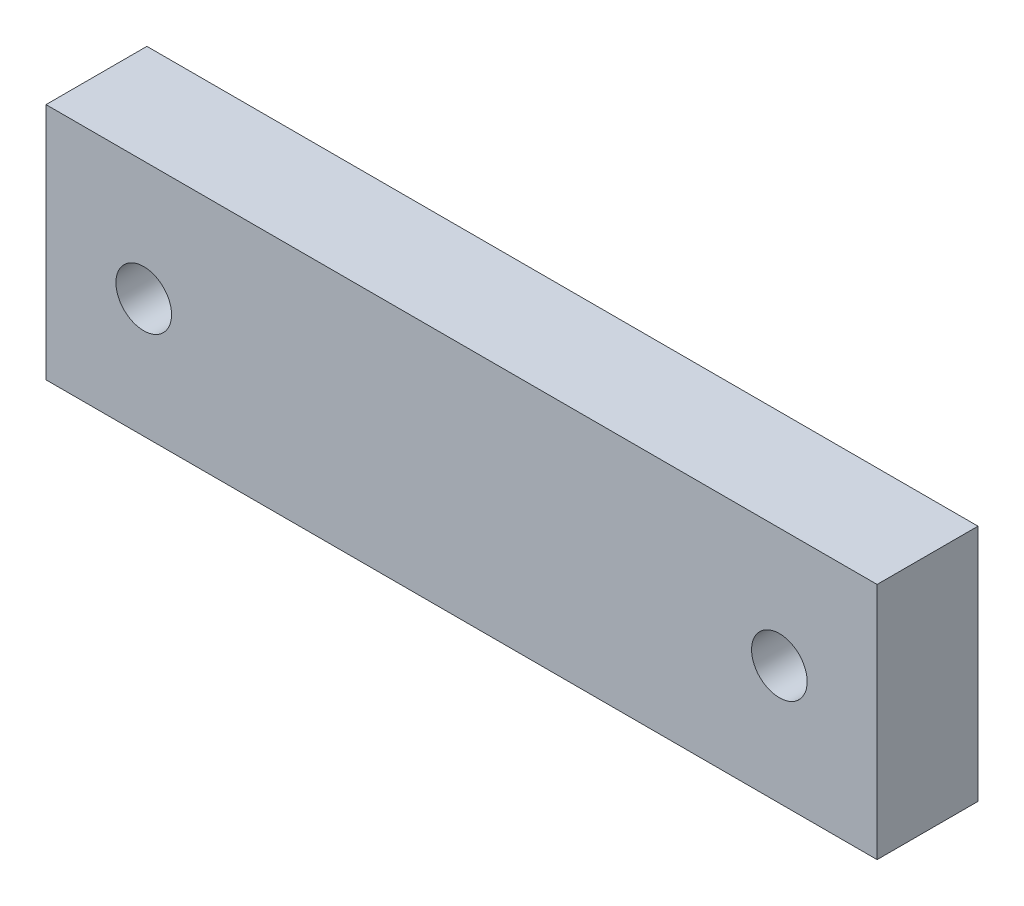
ISO-10303-21;
HEADER;
FILE_DESCRIPTION(('STEP AP214'),'2;1');
FILE_NAME('part.step','',(''),(''),'','','');
FILE_SCHEMA(('AUTOMOTIVE_DESIGN { 1 0 10303 214 1 1 1 1 }'));
ENDSEC;
DATA;
#1=APPLICATION_CONTEXT('core data for automotive mechanical design processes');
#2=APPLICATION_PROTOCOL_DEFINITION('international standard','automotive_design',2000,#1);
#3=PRODUCT_CONTEXT('',#1,'mechanical');
#4=PRODUCT('Part','Part','',(#3));
#5=PRODUCT_RELATED_PRODUCT_CATEGORY('part','',(#4));
#6=PRODUCT_DEFINITION_FORMATION('','',#4);
#7=PRODUCT_DEFINITION_CONTEXT('part definition',#1,'design');
#8=PRODUCT_DEFINITION('design','',#6,#7);
#9=PRODUCT_DEFINITION_SHAPE('','',#8);
#10=(LENGTH_UNIT() NAMED_UNIT(*) SI_UNIT(.MILLI.,.METRE.));
#11=(NAMED_UNIT(*) PLANE_ANGLE_UNIT() SI_UNIT($,.RADIAN.));
#12=(NAMED_UNIT(*) SI_UNIT($,.STERADIAN.) SOLID_ANGLE_UNIT());
#13=UNCERTAINTY_MEASURE_WITH_UNIT(LENGTH_MEASURE(1.E-05),#10,'distance_accuracy_value','');
#14=(GEOMETRIC_REPRESENTATION_CONTEXT(3) GLOBAL_UNCERTAINTY_ASSIGNED_CONTEXT((#13)) GLOBAL_UNIT_ASSIGNED_CONTEXT((#10,
#11,#12)) REPRESENTATION_CONTEXT('',''));
#15=CARTESIAN_POINT('',(0.,0.,0.));
#16=DIRECTION('',(0.,0.,1.));
#17=DIRECTION('',(1.,0.,0.));
#18=AXIS2_PLACEMENT_3D('',#15,#16,#17);
#19=CARTESIAN_POINT('',(0.,0.,6.35));
#20=DIRECTION('',(0.,0.,-1.));
#21=DIRECTION('',(-1.,0.,0.));
#22=AXIS2_PLACEMENT_3D('',#19,#20,#21);
#23=PLANE('',#22);
#24=DIRECTION('',(0.,-1.,0.));
#25=VECTOR('',#24,1.);
#26=CARTESIAN_POINT('',(0.,0.,6.35));
#27=LINE('',#26,#25);
#28=CARTESIAN_POINT('',(0.,15.,6.35));
#29=VERTEX_POINT('',#28);
#30=CARTESIAN_POINT('',(0.,0.,6.35));
#31=VERTEX_POINT('',#30);
#32=EDGE_CURVE('E98',#29,#31,#27,.T.);
#33=ORIENTED_EDGE('',*,*,#32,.T.);
#34=DIRECTION('',(1.,0.,0.));
#35=VECTOR('',#34,1.);
#36=CARTESIAN_POINT('',(0.,0.,6.35));
#37=LINE('',#36,#35);
#38=CARTESIAN_POINT('',(52.3,0.,6.35));
#39=VERTEX_POINT('',#38);
#40=EDGE_CURVE('E93',#31,#39,#37,.T.);
#41=ORIENTED_EDGE('',*,*,#40,.T.);
#42=DIRECTION('',(0.,1.,0.));
#43=VECTOR('',#42,1.);
#44=CARTESIAN_POINT('',(52.3,0.,6.35));
#45=LINE('',#44,#43);
#46=CARTESIAN_POINT('',(52.3,15.,6.35));
#47=VERTEX_POINT('',#46);
#48=EDGE_CURVE('E96',#39,#47,#45,.T.);
#49=ORIENTED_EDGE('',*,*,#48,.T.);
#50=DIRECTION('',(-1.,0.,0.));
#51=VECTOR('',#50,1.);
#52=CARTESIAN_POINT('',(0.,15.,6.35));
#53=LINE('',#52,#51);
#54=EDGE_CURVE('E63',#47,#29,#53,.T.);
#55=ORIENTED_EDGE('',*,*,#54,.T.);
#56=EDGE_LOOP('',(#33,#41,#49,#55));
#57=FACE_BOUND('',#56,.T.);
#58=CARTESIAN_POINT('',(6.15,7.5,6.35));
#59=DIRECTION('',(0.,0.,1.));
#60=DIRECTION('',(1.,0.,0.));
#61=AXIS2_PLACEMENT_3D('',#58,#59,#60);
#62=CIRCLE('',#61,1.75);
#63=CARTESIAN_POINT('',(7.9,7.5,6.35));
#64=VERTEX_POINT('',#63);
#65=EDGE_CURVE('E118',#64,#64,#62,.T.);
#66=ORIENTED_EDGE('',*,*,#65,.F.);
#67=EDGE_LOOP('',(#66));
#68=FACE_BOUND('',#67,.T.);
#69=CARTESIAN_POINT('',(46.15,7.5,6.35));
#70=DIRECTION('',(0.,0.,1.));
#71=DIRECTION('',(1.,0.,0.));
#72=AXIS2_PLACEMENT_3D('',#69,#70,#71);
#73=CIRCLE('',#72,1.75);
#74=CARTESIAN_POINT('',(47.9,7.5,6.35));
#75=VERTEX_POINT('',#74);
#76=EDGE_CURVE('E140',#75,#75,#73,.T.);
#77=ORIENTED_EDGE('',*,*,#76,.F.);
#78=EDGE_LOOP('',(#77));
#79=FACE_BOUND('',#78,.T.);
#80=ADVANCED_FACE('F45',(#57,#68,#79),#23,.F.);
#81=CARTESIAN_POINT('',(0.,0.,0.));
#82=DIRECTION('',(0.,0.,-1.));
#83=DIRECTION('',(-1.,0.,0.));
#84=AXIS2_PLACEMENT_3D('',#81,#82,#83);
#85=PLANE('',#84);
#86=CARTESIAN_POINT('',(6.15,7.5,0.));
#87=DIRECTION('',(0.,0.,1.));
#88=DIRECTION('',(1.,0.,0.));
#89=AXIS2_PLACEMENT_3D('',#86,#87,#88);
#90=CIRCLE('',#89,1.75);
#91=CARTESIAN_POINT('',(7.9,7.5,0.));
#92=VERTEX_POINT('',#91);
#93=EDGE_CURVE('E136',#92,#92,#90,.T.);
#94=ORIENTED_EDGE('',*,*,#93,.T.);
#95=EDGE_LOOP('',(#94));
#96=FACE_BOUND('',#95,.T.);
#97=DIRECTION('',(0.,-1.,0.));
#98=VECTOR('',#97,1.);
#99=CARTESIAN_POINT('',(0.,0.,0.));
#100=LINE('',#99,#98);
#101=CARTESIAN_POINT('',(0.,15.,0.));
#102=VERTEX_POINT('',#101);
#103=CARTESIAN_POINT('',(0.,0.,0.));
#104=VERTEX_POINT('',#103);
#105=EDGE_CURVE('E114',#102,#104,#100,.T.);
#106=ORIENTED_EDGE('',*,*,#105,.F.);
#107=DIRECTION('',(-1.,0.,0.));
#108=VECTOR('',#107,1.);
#109=CARTESIAN_POINT('',(0.,15.,0.));
#110=LINE('',#109,#108);
#111=CARTESIAN_POINT('',(52.3,15.,0.));
#112=VERTEX_POINT('',#111);
#113=EDGE_CURVE('E86',#112,#102,#110,.T.);
#114=ORIENTED_EDGE('',*,*,#113,.F.);
#115=DIRECTION('',(0.,1.,0.));
#116=VECTOR('',#115,1.);
#117=CARTESIAN_POINT('',(52.3,0.,0.));
#118=LINE('',#117,#116);
#119=CARTESIAN_POINT('',(52.3,0.,0.));
#120=VERTEX_POINT('',#119);
#121=EDGE_CURVE('E80',#120,#112,#118,.T.);
#122=ORIENTED_EDGE('',*,*,#121,.F.);
#123=DIRECTION('',(1.,0.,0.));
#124=VECTOR('',#123,1.);
#125=CARTESIAN_POINT('',(0.,0.,0.));
#126=LINE('',#125,#124);
#127=EDGE_CURVE('E103',#104,#120,#126,.T.);
#128=ORIENTED_EDGE('',*,*,#127,.F.);
#129=EDGE_LOOP('',(#106,#114,#122,#128));
#130=FACE_BOUND('',#129,.T.);
#131=CARTESIAN_POINT('',(46.15,7.5,0.));
#132=DIRECTION('',(0.,0.,1.));
#133=DIRECTION('',(1.,0.,0.));
#134=AXIS2_PLACEMENT_3D('',#131,#132,#133);
#135=CIRCLE('',#134,1.75);
#136=CARTESIAN_POINT('',(47.9,7.5,0.));
#137=VERTEX_POINT('',#136);
#138=EDGE_CURVE('E144',#137,#137,#135,.T.);
#139=ORIENTED_EDGE('',*,*,#138,.T.);
#140=EDGE_LOOP('',(#139));
#141=FACE_BOUND('',#140,.T.);
#142=ADVANCED_FACE('F131',(#96,#130,#141),#85,.T.);
#143=CARTESIAN_POINT('',(0.,0.,6.35));
#144=DIRECTION('',(1.,0.,0.));
#145=DIRECTION('',(0.,0.,-1.));
#146=AXIS2_PLACEMENT_3D('',#143,#144,#145);
#147=PLANE('',#146);
#148=ORIENTED_EDGE('',*,*,#105,.T.);
#149=DIRECTION('',(0.,0.,-1.));
#150=VECTOR('',#149,1.);
#151=CARTESIAN_POINT('',(0.,0.,6.35));
#152=LINE('',#151,#150);
#153=EDGE_CURVE('E11',#31,#104,#152,.T.);
#154=ORIENTED_EDGE('',*,*,#153,.F.);
#155=ORIENTED_EDGE('',*,*,#32,.F.);
#156=DIRECTION('',(0.,0.,-1.));
#157=VECTOR('',#156,1.);
#158=CARTESIAN_POINT('',(0.,15.,6.35));
#159=LINE('',#158,#157);
#160=EDGE_CURVE('E110',#29,#102,#159,.T.);
#161=ORIENTED_EDGE('',*,*,#160,.T.);
#162=EDGE_LOOP('',(#148,#154,#155,#161));
#163=FACE_BOUND('',#162,.T.);
#164=ADVANCED_FACE('F47',(#163),#147,.F.);
#165=CARTESIAN_POINT('',(0.,0.,6.35));
#166=DIRECTION('',(0.,1.,0.));
#167=DIRECTION('',(0.,0.,1.));
#168=AXIS2_PLACEMENT_3D('',#165,#166,#167);
#169=PLANE('',#168);
#170=ORIENTED_EDGE('',*,*,#127,.T.);
#171=DIRECTION('',(0.,0.,-1.));
#172=VECTOR('',#171,1.);
#173=CARTESIAN_POINT('',(52.3,0.,6.35));
#174=LINE('',#173,#172);
#175=EDGE_CURVE('E55',#39,#120,#174,.T.);
#176=ORIENTED_EDGE('',*,*,#175,.F.);
#177=ORIENTED_EDGE('',*,*,#40,.F.);
#178=ORIENTED_EDGE('',*,*,#153,.T.);
#179=EDGE_LOOP('',(#170,#176,#177,#178));
#180=FACE_BOUND('',#179,.T.);
#181=ADVANCED_FACE('F102',(#180),#169,.F.);
#182=CARTESIAN_POINT('',(52.3,0.,6.35));
#183=DIRECTION('',(-1.,0.,0.));
#184=DIRECTION('',(0.,0.,1.));
#185=AXIS2_PLACEMENT_3D('',#182,#183,#184);
#186=PLANE('',#185);
#187=ORIENTED_EDGE('',*,*,#121,.T.);
#188=DIRECTION('',(0.,0.,-1.));
#189=VECTOR('',#188,1.);
#190=CARTESIAN_POINT('',(52.3,15.,6.35));
#191=LINE('',#190,#189);
#192=EDGE_CURVE('E105',#47,#112,#191,.T.);
#193=ORIENTED_EDGE('',*,*,#192,.F.);
#194=ORIENTED_EDGE('',*,*,#48,.F.);
#195=ORIENTED_EDGE('',*,*,#175,.T.);
#196=EDGE_LOOP('',(#187,#193,#194,#195));
#197=FACE_BOUND('',#196,.T.);
#198=ADVANCED_FACE('F106',(#197),#186,.F.);
#199=CARTESIAN_POINT('',(0.,15.,6.35));
#200=DIRECTION('',(0.,-1.,0.));
#201=DIRECTION('',(0.,0.,-1.));
#202=AXIS2_PLACEMENT_3D('',#199,#200,#201);
#203=PLANE('',#202);
#204=ORIENTED_EDGE('',*,*,#113,.T.);
#205=ORIENTED_EDGE('',*,*,#160,.F.);
#206=ORIENTED_EDGE('',*,*,#54,.F.);
#207=ORIENTED_EDGE('',*,*,#192,.T.);
#208=EDGE_LOOP('',(#204,#205,#206,#207));
#209=FACE_BOUND('',#208,.T.);
#210=ADVANCED_FACE('F128',(#209),#203,.F.);
#211=CARTESIAN_POINT('',(6.15,7.5,6.35));
#212=DIRECTION('',(0.,0.,-1.));
#213=DIRECTION('',(-1.,0.,0.));
#214=AXIS2_PLACEMENT_3D('',#211,#212,#213);
#215=CYLINDRICAL_SURFACE('',#214,1.75);
#216=ORIENTED_EDGE('',*,*,#65,.T.);
#217=EDGE_LOOP('',(#216));
#218=FACE_BOUND('',#217,.T.);
#219=ORIENTED_EDGE('',*,*,#93,.F.);
#220=EDGE_LOOP('',(#219));
#221=FACE_BOUND('',#220,.T.);
#222=ADVANCED_FACE('F163',(#218,#221),#215,.F.);
#223=CARTESIAN_POINT('',(46.15,7.5,6.35));
#224=DIRECTION('',(0.,0.,-1.));
#225=DIRECTION('',(-1.,0.,0.));
#226=AXIS2_PLACEMENT_3D('',#223,#224,#225);
#227=CYLINDRICAL_SURFACE('',#226,1.75);
#228=ORIENTED_EDGE('',*,*,#76,.T.);
#229=EDGE_LOOP('',(#228));
#230=FACE_BOUND('',#229,.T.);
#231=ORIENTED_EDGE('',*,*,#138,.F.);
#232=EDGE_LOOP('',(#231));
#233=FACE_BOUND('',#232,.T.);
#234=ADVANCED_FACE('F152',(#230,#233),#227,.F.);
#235=CLOSED_SHELL('',(#80,#142,#164,#181,#198,#210,#222,#234));
#236=MANIFOLD_SOLID_BREP('B2',#235);
#237=ADVANCED_BREP_SHAPE_REPRESENTATION('',(#18,#236),#14);
#238=SHAPE_DEFINITION_REPRESENTATION(#9,#237);
ENDSEC;
END-ISO-10303-21;
